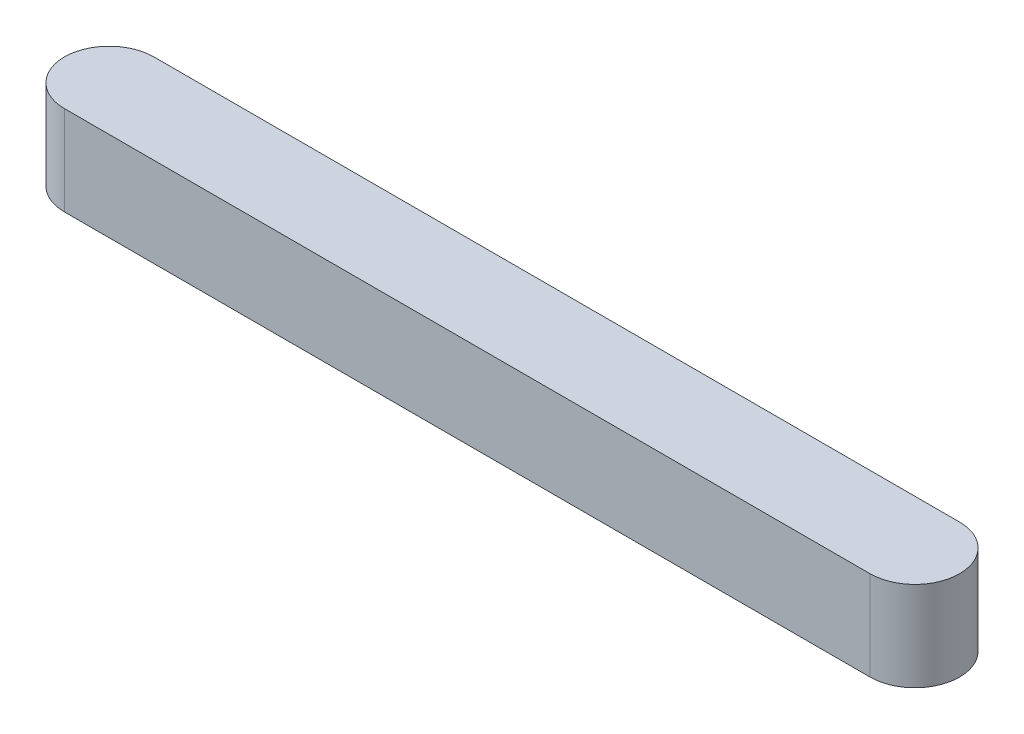
ISO-10303-21;
HEADER;
FILE_DESCRIPTION(('STEP AP214'),'2;1');
FILE_NAME('part.step','',(''),(''),'','','');
FILE_SCHEMA(('AUTOMOTIVE_DESIGN { 1 0 10303 214 1 1 1 1 }'));
ENDSEC;
DATA;
#1=APPLICATION_CONTEXT('core data for automotive mechanical design processes');
#2=APPLICATION_PROTOCOL_DEFINITION('international standard','automotive_design',2000,#1);
#3=PRODUCT_CONTEXT('',#1,'mechanical');
#4=PRODUCT('Part','Part','',(#3));
#5=PRODUCT_RELATED_PRODUCT_CATEGORY('part','',(#4));
#6=PRODUCT_DEFINITION_FORMATION('','',#4);
#7=PRODUCT_DEFINITION_CONTEXT('part definition',#1,'design');
#8=PRODUCT_DEFINITION('design','',#6,#7);
#9=PRODUCT_DEFINITION_SHAPE('','',#8);
#10=(LENGTH_UNIT() NAMED_UNIT(*) SI_UNIT(.MILLI.,.METRE.));
#11=(NAMED_UNIT(*) PLANE_ANGLE_UNIT() SI_UNIT($,.RADIAN.));
#12=(NAMED_UNIT(*) SI_UNIT($,.STERADIAN.) SOLID_ANGLE_UNIT());
#13=UNCERTAINTY_MEASURE_WITH_UNIT(LENGTH_MEASURE(1.E-05),#10,'distance_accuracy_value','');
#14=(GEOMETRIC_REPRESENTATION_CONTEXT(3) GLOBAL_UNCERTAINTY_ASSIGNED_CONTEXT((#13)) GLOBAL_UNIT_ASSIGNED_CONTEXT((#10,
#11,#12)) REPRESENTATION_CONTEXT('',''));
#15=CARTESIAN_POINT('',(0.,0.,0.));
#16=DIRECTION('',(0.,0.,1.));
#17=DIRECTION('',(1.,0.,0.));
#18=AXIS2_PLACEMENT_3D('',#15,#16,#17);
#19=CARTESIAN_POINT('',(9.,2.,0.));
#20=DIRECTION('',(0.,-1.,0.));
#21=DIRECTION('',(0.,0.,-1.));
#22=AXIS2_PLACEMENT_3D('',#19,#20,#21);
#23=CYLINDRICAL_SURFACE('',#22,1.);
#24=CARTESIAN_POINT('',(9.,0.,0.));
#25=DIRECTION('',(0.,1.,0.));
#26=DIRECTION('',(0.,0.,1.));
#27=AXIS2_PLACEMENT_3D('',#24,#25,#26);
#28=CIRCLE('',#27,1.);
#29=CARTESIAN_POINT('',(9.,0.,1.));
#30=VERTEX_POINT('',#29);
#31=CARTESIAN_POINT('',(9.,0.,-1.));
#32=VERTEX_POINT('',#31);
#33=EDGE_CURVE('E96',#30,#32,#28,.T.);
#34=ORIENTED_EDGE('',*,*,#33,.T.);
#35=DIRECTION('',(0.,-1.,0.));
#36=VECTOR('',#35,1.);
#37=CARTESIAN_POINT('',(9.,2.,-1.));
#38=LINE('',#37,#36);
#39=CARTESIAN_POINT('',(9.,2.,-1.));
#40=VERTEX_POINT('',#39);
#41=EDGE_CURVE('E11',#40,#32,#38,.T.);
#42=ORIENTED_EDGE('',*,*,#41,.F.);
#43=CARTESIAN_POINT('',(9.,2.,0.));
#44=DIRECTION('',(0.,1.,0.));
#45=DIRECTION('',(0.,0.,1.));
#46=AXIS2_PLACEMENT_3D('',#43,#44,#45);
#47=CIRCLE('',#46,1.);
#48=CARTESIAN_POINT('',(9.,2.,1.));
#49=VERTEX_POINT('',#48);
#50=EDGE_CURVE('E84',#49,#40,#47,.T.);
#51=ORIENTED_EDGE('',*,*,#50,.F.);
#52=DIRECTION('',(0.,-1.,0.));
#53=VECTOR('',#52,1.);
#54=CARTESIAN_POINT('',(9.,2.,1.));
#55=LINE('',#54,#53);
#56=EDGE_CURVE('E92',#49,#30,#55,.T.);
#57=ORIENTED_EDGE('',*,*,#56,.T.);
#58=EDGE_LOOP('',(#34,#42,#51,#57));
#59=FACE_BOUND('',#58,.T.);
#60=ADVANCED_FACE('F33',(#59),#23,.T.);
#61=CARTESIAN_POINT('',(-9.,2.,-1.));
#62=DIRECTION('',(0.,0.,1.));
#63=DIRECTION('',(1.,0.,0.));
#64=AXIS2_PLACEMENT_3D('',#61,#62,#63);
#65=PLANE('',#64);
#66=DIRECTION('',(-1.,0.,0.));
#67=VECTOR('',#66,1.);
#68=CARTESIAN_POINT('',(-9.,0.,-1.));
#69=LINE('',#68,#67);
#70=CARTESIAN_POINT('',(-9.,0.,-1.));
#71=VERTEX_POINT('',#70);
#72=EDGE_CURVE('E88',#32,#71,#69,.T.);
#73=ORIENTED_EDGE('',*,*,#72,.T.);
#74=DIRECTION('',(0.,-1.,0.));
#75=VECTOR('',#74,1.);
#76=CARTESIAN_POINT('',(-9.,2.,-1.));
#77=LINE('',#76,#75);
#78=CARTESIAN_POINT('',(-9.,2.,-1.));
#79=VERTEX_POINT('',#78);
#80=EDGE_CURVE('E41',#79,#71,#77,.T.);
#81=ORIENTED_EDGE('',*,*,#80,.F.);
#82=DIRECTION('',(-1.,0.,0.));
#83=VECTOR('',#82,1.);
#84=CARTESIAN_POINT('',(-9.,2.,-1.));
#85=LINE('',#84,#83);
#86=EDGE_CURVE('E79',#40,#79,#85,.T.);
#87=ORIENTED_EDGE('',*,*,#86,.F.);
#88=ORIENTED_EDGE('',*,*,#41,.T.);
#89=EDGE_LOOP('',(#73,#81,#87,#88));
#90=FACE_BOUND('',#89,.T.);
#91=ADVANCED_FACE('F87',(#90),#65,.F.);
#92=CARTESIAN_POINT('',(-9.,2.,0.));
#93=DIRECTION('',(0.,-1.,0.));
#94=DIRECTION('',(0.,0.,-1.));
#95=AXIS2_PLACEMENT_3D('',#92,#93,#94);
#96=CYLINDRICAL_SURFACE('',#95,1.);
#97=CARTESIAN_POINT('',(-9.,0.,0.));
#98=DIRECTION('',(0.,1.,0.));
#99=DIRECTION('',(0.,0.,1.));
#100=AXIS2_PLACEMENT_3D('',#97,#98,#99);
#101=CIRCLE('',#100,1.);
#102=CARTESIAN_POINT('',(-9.,0.,1.));
#103=VERTEX_POINT('',#102);
#104=EDGE_CURVE('E66',#71,#103,#101,.T.);
#105=ORIENTED_EDGE('',*,*,#104,.T.);
#106=DIRECTION('',(0.,-1.,0.));
#107=VECTOR('',#106,1.);
#108=CARTESIAN_POINT('',(-9.,2.,1.));
#109=LINE('',#108,#107);
#110=CARTESIAN_POINT('',(-9.,2.,1.));
#111=VERTEX_POINT('',#110);
#112=EDGE_CURVE('E89',#111,#103,#109,.T.);
#113=ORIENTED_EDGE('',*,*,#112,.F.);
#114=CARTESIAN_POINT('',(-9.,2.,0.));
#115=DIRECTION('',(0.,1.,0.));
#116=DIRECTION('',(0.,0.,1.));
#117=AXIS2_PLACEMENT_3D('',#114,#115,#116);
#118=CIRCLE('',#117,1.);
#119=EDGE_CURVE('E82',#79,#111,#118,.T.);
#120=ORIENTED_EDGE('',*,*,#119,.F.);
#121=ORIENTED_EDGE('',*,*,#80,.T.);
#122=EDGE_LOOP('',(#105,#113,#120,#121));
#123=FACE_BOUND('',#122,.T.);
#124=ADVANCED_FACE('F90',(#123),#96,.T.);
#125=CARTESIAN_POINT('',(-9.,2.,1.));
#126=DIRECTION('',(0.,0.,-1.));
#127=DIRECTION('',(-1.,0.,0.));
#128=AXIS2_PLACEMENT_3D('',#125,#126,#127);
#129=PLANE('',#128);
#130=DIRECTION('',(1.,0.,0.));
#131=VECTOR('',#130,1.);
#132=CARTESIAN_POINT('',(-9.,0.,1.));
#133=LINE('',#132,#131);
#134=EDGE_CURVE('E72',#103,#30,#133,.T.);
#135=ORIENTED_EDGE('',*,*,#134,.T.);
#136=ORIENTED_EDGE('',*,*,#56,.F.);
#137=DIRECTION('',(1.,0.,0.));
#138=VECTOR('',#137,1.);
#139=CARTESIAN_POINT('',(-9.,2.,1.));
#140=LINE('',#139,#138);
#141=EDGE_CURVE('E49',#111,#49,#140,.T.);
#142=ORIENTED_EDGE('',*,*,#141,.F.);
#143=ORIENTED_EDGE('',*,*,#112,.T.);
#144=EDGE_LOOP('',(#135,#136,#142,#143));
#145=FACE_BOUND('',#144,.T.);
#146=ADVANCED_FACE('F103',(#145),#129,.F.);
#147=CARTESIAN_POINT('',(9.,2.,0.));
#148=DIRECTION('',(0.,1.,0.));
#149=DIRECTION('',(0.,0.,1.));
#150=AXIS2_PLACEMENT_3D('',#147,#148,#149);
#151=PLANE('',#150);
#152=ORIENTED_EDGE('',*,*,#50,.T.);
#153=ORIENTED_EDGE('',*,*,#86,.T.);
#154=ORIENTED_EDGE('',*,*,#119,.T.);
#155=ORIENTED_EDGE('',*,*,#141,.T.);
#156=EDGE_LOOP('',(#152,#153,#154,#155));
#157=FACE_BOUND('',#156,.T.);
#158=ADVANCED_FACE('F80',(#157),#151,.T.);
#159=CARTESIAN_POINT('',(9.,0.,0.));
#160=DIRECTION('',(0.,1.,0.));
#161=DIRECTION('',(0.,0.,1.));
#162=AXIS2_PLACEMENT_3D('',#159,#160,#161);
#163=PLANE('',#162);
#164=ORIENTED_EDGE('',*,*,#33,.F.);
#165=ORIENTED_EDGE('',*,*,#134,.F.);
#166=ORIENTED_EDGE('',*,*,#104,.F.);
#167=ORIENTED_EDGE('',*,*,#72,.F.);
#168=EDGE_LOOP('',(#164,#165,#166,#167));
#169=FACE_BOUND('',#168,.T.);
#170=ADVANCED_FACE('F106',(#169),#163,.F.);
#171=CLOSED_SHELL('',(#60,#91,#124,#146,#158,#170));
#172=MANIFOLD_SOLID_BREP('B2',#171);
#173=ADVANCED_BREP_SHAPE_REPRESENTATION('',(#18,#172),#14);
#174=SHAPE_DEFINITION_REPRESENTATION(#9,#173);
ENDSEC;
END-ISO-10303-21;
